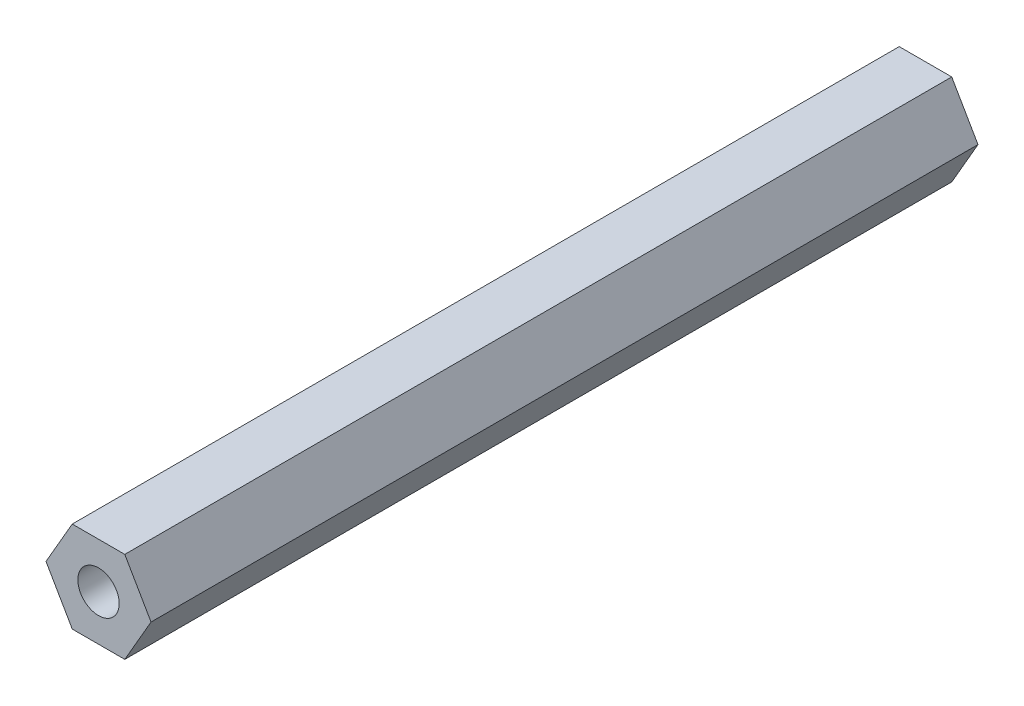
ISO-10303-21;
HEADER;
FILE_DESCRIPTION(('STEP AP214'),'2;1');
FILE_NAME('part.step','',(''),(''),'','','');
FILE_SCHEMA(('AUTOMOTIVE_DESIGN { 1 0 10303 214 1 1 1 1 }'));
ENDSEC;
DATA;
#1=APPLICATION_CONTEXT('core data for automotive mechanical design processes');
#2=APPLICATION_PROTOCOL_DEFINITION('international standard','automotive_design',2000,#1);
#3=PRODUCT_CONTEXT('',#1,'mechanical');
#4=PRODUCT('Part','Part','',(#3));
#5=PRODUCT_RELATED_PRODUCT_CATEGORY('part','',(#4));
#6=PRODUCT_DEFINITION_FORMATION('','',#4);
#7=PRODUCT_DEFINITION_CONTEXT('part definition',#1,'design');
#8=PRODUCT_DEFINITION('design','',#6,#7);
#9=PRODUCT_DEFINITION_SHAPE('','',#8);
#10=(LENGTH_UNIT() NAMED_UNIT(*) SI_UNIT(.MILLI.,.METRE.));
#11=(NAMED_UNIT(*) PLANE_ANGLE_UNIT() SI_UNIT($,.RADIAN.));
#12=(NAMED_UNIT(*) SI_UNIT($,.STERADIAN.) SOLID_ANGLE_UNIT());
#13=UNCERTAINTY_MEASURE_WITH_UNIT(LENGTH_MEASURE(1.E-05),#10,'distance_accuracy_value','');
#14=(GEOMETRIC_REPRESENTATION_CONTEXT(3) GLOBAL_UNCERTAINTY_ASSIGNED_CONTEXT((#13)) GLOBAL_UNIT_ASSIGNED_CONTEXT((#10,
#11,#12)) REPRESENTATION_CONTEXT('',''));
#15=CARTESIAN_POINT('',(0.,0.,0.));
#16=DIRECTION('',(0.,0.,1.));
#17=DIRECTION('',(1.,0.,0.));
#18=AXIS2_PLACEMENT_3D('',#15,#16,#17);
#19=CARTESIAN_POINT('',(1.58771324027147,-2.75,50.));
#20=DIRECTION('',(-0.866025403784439,0.5,0.));
#21=DIRECTION('',(-0.5,-0.866025403784439,0.));
#22=AXIS2_PLACEMENT_3D('',#19,#20,#21);
#23=PLANE('',#22);
#24=DIRECTION('',(0.5,0.866025403784439,0.));
#25=VECTOR('',#24,1.);
#26=CARTESIAN_POINT('',(1.58771324027147,-2.75,0.));
#27=LINE('',#26,#25);
#28=CARTESIAN_POINT('',(1.58771324027147,-2.75,0.));
#29=VERTEX_POINT('',#28);
#30=CARTESIAN_POINT('',(3.17542648054294,0.,0.));
#31=VERTEX_POINT('',#30);
#32=EDGE_CURVE('E120',#29,#31,#27,.T.);
#33=ORIENTED_EDGE('',*,*,#32,.T.);
#34=DIRECTION('',(0.,0.,-1.));
#35=VECTOR('',#34,1.);
#36=CARTESIAN_POINT('',(3.17542648054294,0.,50.));
#37=LINE('',#36,#35);
#38=CARTESIAN_POINT('',(3.17542648054294,0.,50.));
#39=VERTEX_POINT('',#38);
#40=EDGE_CURVE('E11',#39,#31,#37,.T.);
#41=ORIENTED_EDGE('',*,*,#40,.F.);
#42=DIRECTION('',(0.5,0.866025403784439,0.));
#43=VECTOR('',#42,1.);
#44=CARTESIAN_POINT('',(1.58771324027147,-2.75,50.));
#45=LINE('',#44,#43);
#46=CARTESIAN_POINT('',(1.58771324027147,-2.75,50.));
#47=VERTEX_POINT('',#46);
#48=EDGE_CURVE('E131',#47,#39,#45,.T.);
#49=ORIENTED_EDGE('',*,*,#48,.F.);
#50=DIRECTION('',(0.,0.,-1.));
#51=VECTOR('',#50,1.);
#52=CARTESIAN_POINT('',(1.58771324027147,-2.75,50.));
#53=LINE('',#52,#51);
#54=EDGE_CURVE('E116',#47,#29,#53,.T.);
#55=ORIENTED_EDGE('',*,*,#54,.T.);
#56=EDGE_LOOP('',(#33,#41,#49,#55));
#57=FACE_BOUND('',#56,.T.);
#58=ADVANCED_FACE('F36',(#57),#23,.F.);
#59=CARTESIAN_POINT('',(3.17542648054294,0.,50.));
#60=DIRECTION('',(-0.866025403784439,-0.5,0.));
#61=DIRECTION('',(0.5,-0.866025403784439,0.));
#62=AXIS2_PLACEMENT_3D('',#59,#60,#61);
#63=PLANE('',#62);
#64=DIRECTION('',(-0.5,0.866025403784439,0.));
#65=VECTOR('',#64,1.);
#66=CARTESIAN_POINT('',(3.17542648054294,0.,0.));
#67=LINE('',#66,#65);
#68=CARTESIAN_POINT('',(1.58771324027147,2.75,0.));
#69=VERTEX_POINT('',#68);
#70=EDGE_CURVE('E123',#31,#69,#67,.T.);
#71=ORIENTED_EDGE('',*,*,#70,.T.);
#72=DIRECTION('',(0.,0.,-1.));
#73=VECTOR('',#72,1.);
#74=CARTESIAN_POINT('',(1.58771324027147,2.75,50.));
#75=LINE('',#74,#73);
#76=CARTESIAN_POINT('',(1.58771324027147,2.75,50.));
#77=VERTEX_POINT('',#76);
#78=EDGE_CURVE('E44',#77,#69,#75,.T.);
#79=ORIENTED_EDGE('',*,*,#78,.F.);
#80=DIRECTION('',(-0.5,0.866025403784439,0.));
#81=VECTOR('',#80,1.);
#82=CARTESIAN_POINT('',(3.17542648054294,0.,50.));
#83=LINE('',#82,#81);
#84=EDGE_CURVE('E89',#39,#77,#83,.T.);
#85=ORIENTED_EDGE('',*,*,#84,.F.);
#86=ORIENTED_EDGE('',*,*,#40,.T.);
#87=EDGE_LOOP('',(#71,#79,#85,#86));
#88=FACE_BOUND('',#87,.T.);
#89=ADVANCED_FACE('F156',(#88),#63,.F.);
#90=CARTESIAN_POINT('',(1.58771324027147,2.75,50.));
#91=DIRECTION('',(0.,-1.,0.));
#92=DIRECTION('',(0.,0.,-1.));
#93=AXIS2_PLACEMENT_3D('',#90,#91,#92);
#94=PLANE('',#93);
#95=DIRECTION('',(-1.,0.,0.));
#96=VECTOR('',#95,1.);
#97=CARTESIAN_POINT('',(1.58771324027147,2.75,0.));
#98=LINE('',#97,#96);
#99=CARTESIAN_POINT('',(-1.58771324027147,2.75,0.));
#100=VERTEX_POINT('',#99);
#101=EDGE_CURVE('E126',#69,#100,#98,.T.);
#102=ORIENTED_EDGE('',*,*,#101,.T.);
#103=DIRECTION('',(0.,0.,-1.));
#104=VECTOR('',#103,1.);
#105=CARTESIAN_POINT('',(-1.58771324027147,2.75,50.));
#106=LINE('',#105,#104);
#107=CARTESIAN_POINT('',(-1.58771324027147,2.75,50.));
#108=VERTEX_POINT('',#107);
#109=EDGE_CURVE('E111',#108,#100,#106,.T.);
#110=ORIENTED_EDGE('',*,*,#109,.F.);
#111=DIRECTION('',(-1.,0.,0.));
#112=VECTOR('',#111,1.);
#113=CARTESIAN_POINT('',(1.58771324027147,2.75,50.));
#114=LINE('',#113,#112);
#115=EDGE_CURVE('E102',#77,#108,#114,.T.);
#116=ORIENTED_EDGE('',*,*,#115,.F.);
#117=ORIENTED_EDGE('',*,*,#78,.T.);
#118=EDGE_LOOP('',(#102,#110,#116,#117));
#119=FACE_BOUND('',#118,.T.);
#120=ADVANCED_FACE('F137',(#119),#94,.F.);
#121=CARTESIAN_POINT('',(-1.58771324027147,2.75,50.));
#122=DIRECTION('',(0.866025403784439,-0.5,0.));
#123=DIRECTION('',(0.5,0.866025403784439,0.));
#124=AXIS2_PLACEMENT_3D('',#121,#122,#123);
#125=PLANE('',#124);
#126=DIRECTION('',(-0.5,-0.866025403784439,0.));
#127=VECTOR('',#126,1.);
#128=CARTESIAN_POINT('',(-1.58771324027147,2.75,0.));
#129=LINE('',#128,#127);
#130=CARTESIAN_POINT('',(-3.17542648054294,0.,0.));
#131=VERTEX_POINT('',#130);
#132=EDGE_CURVE('E110',#100,#131,#129,.T.);
#133=ORIENTED_EDGE('',*,*,#132,.T.);
#134=DIRECTION('',(0.,0.,-1.));
#135=VECTOR('',#134,1.);
#136=CARTESIAN_POINT('',(-3.17542648054294,0.,50.));
#137=LINE('',#136,#135);
#138=CARTESIAN_POINT('',(-3.17542648054294,0.,50.));
#139=VERTEX_POINT('',#138);
#140=EDGE_CURVE('E107',#139,#131,#137,.T.);
#141=ORIENTED_EDGE('',*,*,#140,.F.);
#142=DIRECTION('',(-0.5,-0.866025403784439,0.));
#143=VECTOR('',#142,1.);
#144=CARTESIAN_POINT('',(-1.58771324027147,2.75,50.));
#145=LINE('',#144,#143);
#146=EDGE_CURVE('E96',#108,#139,#145,.T.);
#147=ORIENTED_EDGE('',*,*,#146,.F.);
#148=ORIENTED_EDGE('',*,*,#109,.T.);
#149=EDGE_LOOP('',(#133,#141,#147,#148));
#150=FACE_BOUND('',#149,.T.);
#151=ADVANCED_FACE('F108',(#150),#125,.F.);
#152=CARTESIAN_POINT('',(-3.17542648054294,0.,50.));
#153=DIRECTION('',(0.866025403784438,0.5,0.));
#154=DIRECTION('',(-0.5,0.866025403784439,0.));
#155=AXIS2_PLACEMENT_3D('',#152,#153,#154);
#156=PLANE('',#155);
#157=DIRECTION('',(0.5,-0.866025403784438,0.));
#158=VECTOR('',#157,1.);
#159=CARTESIAN_POINT('',(-3.17542648054294,0.,0.));
#160=LINE('',#159,#158);
#161=CARTESIAN_POINT('',(-1.58771324027147,-2.75,0.));
#162=VERTEX_POINT('',#161);
#163=EDGE_CURVE('E75',#131,#162,#160,.T.);
#164=ORIENTED_EDGE('',*,*,#163,.T.);
#165=DIRECTION('',(0.,0.,-1.));
#166=VECTOR('',#165,1.);
#167=CARTESIAN_POINT('',(-1.58771324027147,-2.75,50.));
#168=LINE('',#167,#166);
#169=CARTESIAN_POINT('',(-1.58771324027147,-2.75,50.));
#170=VERTEX_POINT('',#169);
#171=EDGE_CURVE('E112',#170,#162,#168,.T.);
#172=ORIENTED_EDGE('',*,*,#171,.F.);
#173=DIRECTION('',(0.5,-0.866025403784438,0.));
#174=VECTOR('',#173,1.);
#175=CARTESIAN_POINT('',(-3.17542648054294,0.,50.));
#176=LINE('',#175,#174);
#177=EDGE_CURVE('E100',#139,#170,#176,.T.);
#178=ORIENTED_EDGE('',*,*,#177,.F.);
#179=ORIENTED_EDGE('',*,*,#140,.T.);
#180=EDGE_LOOP('',(#164,#172,#178,#179));
#181=FACE_BOUND('',#180,.T.);
#182=ADVANCED_FACE('F114',(#181),#156,.F.);
#183=CARTESIAN_POINT('',(-1.58771324027147,-2.75,50.));
#184=DIRECTION('',(0.,1.,0.));
#185=DIRECTION('',(-1.,0.,0.));
#186=AXIS2_PLACEMENT_3D('',#183,#184,#185);
#187=PLANE('',#186);
#188=DIRECTION('',(1.,0.,0.));
#189=VECTOR('',#188,1.);
#190=CARTESIAN_POINT('',(-1.58771324027147,-2.75,0.));
#191=LINE('',#190,#189);
#192=EDGE_CURVE('E81',#162,#29,#191,.T.);
#193=ORIENTED_EDGE('',*,*,#192,.T.);
#194=ORIENTED_EDGE('',*,*,#54,.F.);
#195=DIRECTION('',(1.,0.,0.));
#196=VECTOR('',#195,1.);
#197=CARTESIAN_POINT('',(-1.58771324027147,-2.75,50.));
#198=LINE('',#197,#196);
#199=EDGE_CURVE('E52',#170,#47,#198,.T.);
#200=ORIENTED_EDGE('',*,*,#199,.F.);
#201=ORIENTED_EDGE('',*,*,#171,.T.);
#202=EDGE_LOOP('',(#193,#194,#200,#201));
#203=FACE_BOUND('',#202,.T.);
#204=ADVANCED_FACE('F144',(#203),#187,.F.);
#205=CARTESIAN_POINT('',(0.,0.,50.));
#206=DIRECTION('',(0.,0.,1.));
#207=DIRECTION('',(1.,0.,0.));
#208=AXIS2_PLACEMENT_3D('',#205,#206,#207);
#209=PLANE('',#208);
#210=CARTESIAN_POINT('',(0.,0.,50.));
#211=DIRECTION('',(0.,0.,1.));
#212=DIRECTION('',(1.,0.,0.));
#213=AXIS2_PLACEMENT_3D('',#210,#211,#212);
#214=CIRCLE('',#213,1.24999999999999);
#215=CARTESIAN_POINT('',(1.24999999999999,0.,50.));
#216=VERTEX_POINT('',#215);
#217=EDGE_CURVE('E216',#216,#216,#214,.T.);
#218=ORIENTED_EDGE('',*,*,#217,.F.);
#219=EDGE_LOOP('',(#218));
#220=FACE_BOUND('',#219,.T.);
#221=ORIENTED_EDGE('',*,*,#48,.T.);
#222=ORIENTED_EDGE('',*,*,#84,.T.);
#223=ORIENTED_EDGE('',*,*,#115,.T.);
#224=ORIENTED_EDGE('',*,*,#146,.T.);
#225=ORIENTED_EDGE('',*,*,#177,.T.);
#226=ORIENTED_EDGE('',*,*,#199,.T.);
#227=EDGE_LOOP('',(#221,#222,#223,#224,#225,#226));
#228=FACE_BOUND('',#227,.T.);
#229=ADVANCED_FACE('F98',(#220,#228),#209,.T.);
#230=CARTESIAN_POINT('',(0.,0.,0.));
#231=DIRECTION('',(0.,0.,1.));
#232=DIRECTION('',(1.,0.,0.));
#233=AXIS2_PLACEMENT_3D('',#230,#231,#232);
#234=PLANE('',#233);
#235=CARTESIAN_POINT('',(0.,0.,0.));
#236=DIRECTION('',(0.,0.,1.));
#237=DIRECTION('',(1.,0.,0.));
#238=AXIS2_PLACEMENT_3D('',#235,#236,#237);
#239=CIRCLE('',#238,1.24999999999999);
#240=CARTESIAN_POINT('',(1.24999999999999,0.,0.));
#241=VERTEX_POINT('',#240);
#242=EDGE_CURVE('E124',#241,#241,#239,.T.);
#243=ORIENTED_EDGE('',*,*,#242,.T.);
#244=EDGE_LOOP('',(#243));
#245=FACE_BOUND('',#244,.T.);
#246=ORIENTED_EDGE('',*,*,#32,.F.);
#247=ORIENTED_EDGE('',*,*,#192,.F.);
#248=ORIENTED_EDGE('',*,*,#163,.F.);
#249=ORIENTED_EDGE('',*,*,#132,.F.);
#250=ORIENTED_EDGE('',*,*,#101,.F.);
#251=ORIENTED_EDGE('',*,*,#70,.F.);
#252=EDGE_LOOP('',(#246,#247,#248,#249,#250,#251));
#253=FACE_BOUND('',#252,.T.);
#254=ADVANCED_FACE('F140',(#245,#253),#234,.F.);
#255=CARTESIAN_POINT('',(0.,0.,50.));
#256=DIRECTION('',(0.,0.,1.));
#257=DIRECTION('',(1.,0.,0.));
#258=AXIS2_PLACEMENT_3D('',#255,#256,#257);
#259=CYLINDRICAL_SURFACE('',#258,1.24999999999999);
#260=ORIENTED_EDGE('',*,*,#242,.F.);
#261=EDGE_LOOP('',(#260));
#262=FACE_BOUND('',#261,.T.);
#263=ORIENTED_EDGE('',*,*,#217,.T.);
#264=EDGE_LOOP('',(#263));
#265=FACE_BOUND('',#264,.T.);
#266=ADVANCED_FACE('F195',(#262,#265),#259,.F.);
#267=CLOSED_SHELL('',(#58,#89,#120,#151,#182,#204,#229,#254,#266));
#268=MANIFOLD_SOLID_BREP('B2',#267);
#269=ADVANCED_BREP_SHAPE_REPRESENTATION('',(#18,#268),#14);
#270=SHAPE_DEFINITION_REPRESENTATION(#9,#269);
ENDSEC;
END-ISO-10303-21;
